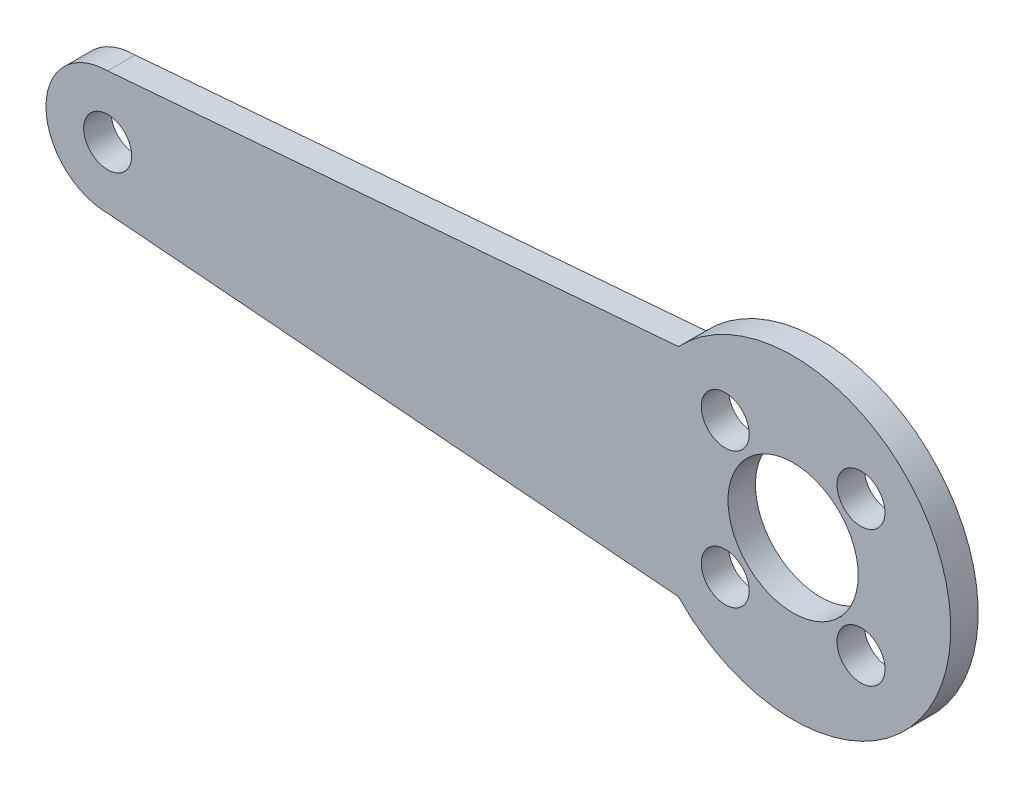
ISO-10303-21;
HEADER;
FILE_DESCRIPTION(('STEP AP214'),'2;1');
FILE_NAME('part.step','',(''),(''),'','','');
FILE_SCHEMA(('AUTOMOTIVE_DESIGN { 1 0 10303 214 1 1 1 1 }'));
ENDSEC;
DATA;
#1=APPLICATION_CONTEXT('core data for automotive mechanical design processes');
#2=APPLICATION_PROTOCOL_DEFINITION('international standard','automotive_design',2000,#1);
#3=PRODUCT_CONTEXT('',#1,'mechanical');
#4=PRODUCT('Part','Part','',(#3));
#5=PRODUCT_RELATED_PRODUCT_CATEGORY('part','',(#4));
#6=PRODUCT_DEFINITION_FORMATION('','',#4);
#7=PRODUCT_DEFINITION_CONTEXT('part definition',#1,'design');
#8=PRODUCT_DEFINITION('design','',#6,#7);
#9=PRODUCT_DEFINITION_SHAPE('','',#8);
#10=(LENGTH_UNIT() NAMED_UNIT(*) SI_UNIT(.MILLI.,.METRE.));
#11=(NAMED_UNIT(*) PLANE_ANGLE_UNIT() SI_UNIT($,.RADIAN.));
#12=(NAMED_UNIT(*) SI_UNIT($,.STERADIAN.) SOLID_ANGLE_UNIT());
#13=UNCERTAINTY_MEASURE_WITH_UNIT(LENGTH_MEASURE(1.E-05),#10,'distance_accuracy_value','');
#14=(GEOMETRIC_REPRESENTATION_CONTEXT(3) GLOBAL_UNCERTAINTY_ASSIGNED_CONTEXT((#13)) GLOBAL_UNIT_ASSIGNED_CONTEXT((#10,
#11,#12)) REPRESENTATION_CONTEXT('',''));
#15=CARTESIAN_POINT('',(0.,0.,0.));
#16=DIRECTION('',(0.,0.,1.));
#17=DIRECTION('',(1.,0.,0.));
#18=AXIS2_PLACEMENT_3D('',#15,#16,#17);
#19=CARTESIAN_POINT('',(-50.,0.,2.));
#20=DIRECTION('',(0.,0.,1.));
#21=DIRECTION('',(1.,0.,0.));
#22=AXIS2_PLACEMENT_3D('',#19,#20,#21);
#23=PLANE('',#22);
#24=CARTESIAN_POINT('',(0.,0.,2.));
#25=DIRECTION('',(0.,0.,1.));
#26=DIRECTION('',(1.,0.,0.));
#27=AXIS2_PLACEMENT_3D('',#24,#25,#26);
#28=CIRCLE('',#27,4.75);
#29=CARTESIAN_POINT('',(4.75,0.,2.));
#30=VERTEX_POINT('',#29);
#31=EDGE_CURVE('E229',#30,#30,#28,.T.);
#32=ORIENTED_EDGE('',*,*,#31,.F.);
#33=EDGE_LOOP('',(#32));
#34=FACE_BOUND('',#33,.T.);
#35=CARTESIAN_POINT('',(4.94974746830582,-4.94974746830585,2.));
#36=DIRECTION('',(0.,0.,1.));
#37=DIRECTION('',(1.,0.,0.));
#38=AXIS2_PLACEMENT_3D('',#35,#36,#37);
#39=CIRCLE('',#38,1.75);
#40=CARTESIAN_POINT('',(6.69974746830582,-4.94974746830585,2.));
#41=VERTEX_POINT('',#40);
#42=EDGE_CURVE('E214',#41,#41,#39,.T.);
#43=ORIENTED_EDGE('',*,*,#42,.F.);
#44=EDGE_LOOP('',(#43));
#45=FACE_BOUND('',#44,.T.);
#46=CARTESIAN_POINT('',(4.94974746830583,4.94974746830583,2.));
#47=DIRECTION('',(0.,0.,1.));
#48=DIRECTION('',(1.,0.,0.));
#49=AXIS2_PLACEMENT_3D('',#46,#47,#48);
#50=CIRCLE('',#49,1.75);
#51=CARTESIAN_POINT('',(6.69974746830583,4.94974746830583,2.));
#52=VERTEX_POINT('',#51);
#53=EDGE_CURVE('E202',#52,#52,#50,.T.);
#54=ORIENTED_EDGE('',*,*,#53,.F.);
#55=EDGE_LOOP('',(#54));
#56=FACE_BOUND('',#55,.T.);
#57=CARTESIAN_POINT('',(-50.,0.,2.));
#58=DIRECTION('',(0.,0.,1.));
#59=DIRECTION('',(1.,0.,0.));
#60=AXIS2_PLACEMENT_3D('',#57,#58,#59);
#61=CIRCLE('',#60,4.5);
#62=CARTESIAN_POINT('',(-50.,4.49999999999999,2.));
#63=VERTEX_POINT('',#62);
#64=CARTESIAN_POINT('',(-50.,-4.50000000000001,2.));
#65=VERTEX_POINT('',#64);
#66=EDGE_CURVE('E173',#63,#65,#61,.T.);
#67=ORIENTED_EDGE('',*,*,#66,.T.);
#68=DIRECTION('',(0.99667848722668,-0.0814370499191635,0.));
#69=VECTOR('',#68,1.);
#70=CARTESIAN_POINT('',(-50.,-4.50000000000001,2.));
#71=LINE('',#70,#69);
#72=CARTESIAN_POINT('',(-8.35438679497923,-7.90279831957496,2.));
#73=VERTEX_POINT('',#72);
#74=EDGE_CURVE('E166',#65,#73,#71,.T.);
#75=ORIENTED_EDGE('',*,*,#74,.T.);
#76=CARTESIAN_POINT('',(0.,0.,2.));
#77=DIRECTION('',(0.,0.,1.));
#78=DIRECTION('',(1.,0.,0.));
#79=AXIS2_PLACEMENT_3D('',#76,#77,#78);
#80=CIRCLE('',#79,11.5);
#81=CARTESIAN_POINT('',(-8.35438679497923,7.90279831957495,2.));
#82=VERTEX_POINT('',#81);
#83=EDGE_CURVE('E172',#73,#82,#80,.T.);
#84=ORIENTED_EDGE('',*,*,#83,.T.);
#85=DIRECTION('',(0.99667848722668,0.0814370499191637,0.));
#86=VECTOR('',#85,1.);
#87=CARTESIAN_POINT('',(-50.,4.49999999999999,2.));
#88=LINE('',#87,#86);
#89=EDGE_CURVE('E182',#63,#82,#88,.T.);
#90=ORIENTED_EDGE('',*,*,#89,.F.);
#91=EDGE_LOOP('',(#67,#75,#84,#90));
#92=FACE_BOUND('',#91,.T.);
#93=CARTESIAN_POINT('',(-50.,0.,2.));
#94=DIRECTION('',(0.,0.,1.));
#95=DIRECTION('',(1.,0.,0.));
#96=AXIS2_PLACEMENT_3D('',#93,#94,#95);
#97=CIRCLE('',#96,1.75);
#98=CARTESIAN_POINT('',(-48.25,0.,2.));
#99=VERTEX_POINT('',#98);
#100=EDGE_CURVE('E189',#99,#99,#97,.T.);
#101=ORIENTED_EDGE('',*,*,#100,.F.);
#102=EDGE_LOOP('',(#101));
#103=FACE_BOUND('',#102,.T.);
#104=CARTESIAN_POINT('',(-4.94974746830578,4.94974746830588,2.));
#105=DIRECTION('',(0.,0.,1.));
#106=DIRECTION('',(1.,0.,0.));
#107=AXIS2_PLACEMENT_3D('',#104,#105,#106);
#108=CIRCLE('',#107,1.75);
#109=CARTESIAN_POINT('',(-3.19974746830578,4.94974746830588,2.));
#110=VERTEX_POINT('',#109);
#111=EDGE_CURVE('E208',#110,#110,#108,.T.);
#112=ORIENTED_EDGE('',*,*,#111,.F.);
#113=EDGE_LOOP('',(#112));
#114=FACE_BOUND('',#113,.T.);
#115=CARTESIAN_POINT('',(-4.94974746830528,-4.94974746830639,2.));
#116=DIRECTION('',(0.,0.,1.));
#117=DIRECTION('',(1.,0.,0.));
#118=AXIS2_PLACEMENT_3D('',#115,#116,#117);
#119=CIRCLE('',#118,1.75000000000039);
#120=CARTESIAN_POINT('',(-3.19974746830488,-4.94974746830639,2.));
#121=VERTEX_POINT('',#120);
#122=EDGE_CURVE('E220',#121,#121,#119,.T.);
#123=ORIENTED_EDGE('',*,*,#122,.F.);
#124=EDGE_LOOP('',(#123));
#125=FACE_BOUND('',#124,.T.);
#126=ADVANCED_FACE('F123',(#34,#45,#56,#92,#103,#114,#125),#23,.T.);
#127=CARTESIAN_POINT('',(-50.,0.,0.));
#128=DIRECTION('',(0.,0.,1.));
#129=DIRECTION('',(1.,0.,0.));
#130=AXIS2_PLACEMENT_3D('',#127,#128,#129);
#131=PLANE('',#130);
#132=CARTESIAN_POINT('',(0.,0.,0.));
#133=DIRECTION('',(0.,0.,1.));
#134=DIRECTION('',(1.,0.,0.));
#135=AXIS2_PLACEMENT_3D('',#132,#133,#134);
#136=CIRCLE('',#135,4.75);
#137=CARTESIAN_POINT('',(4.75,0.,0.));
#138=VERTEX_POINT('',#137);
#139=EDGE_CURVE('E226',#138,#138,#136,.T.);
#140=ORIENTED_EDGE('',*,*,#139,.T.);
#141=EDGE_LOOP('',(#140));
#142=FACE_BOUND('',#141,.T.);
#143=CARTESIAN_POINT('',(-50.,0.,0.));
#144=DIRECTION('',(0.,0.,1.));
#145=DIRECTION('',(1.,0.,0.));
#146=AXIS2_PLACEMENT_3D('',#143,#144,#145);
#147=CIRCLE('',#146,4.5);
#148=CARTESIAN_POINT('',(-50.,4.49999999999999,0.));
#149=VERTEX_POINT('',#148);
#150=CARTESIAN_POINT('',(-50.,-4.50000000000001,0.));
#151=VERTEX_POINT('',#150);
#152=EDGE_CURVE('E187',#149,#151,#147,.T.);
#153=ORIENTED_EDGE('',*,*,#152,.F.);
#154=DIRECTION('',(0.99667848722668,0.0814370499191637,0.));
#155=VECTOR('',#154,1.);
#156=CARTESIAN_POINT('',(-50.,4.49999999999999,0.));
#157=LINE('',#156,#155);
#158=CARTESIAN_POINT('',(-8.35438679497923,7.90279831957495,0.));
#159=VERTEX_POINT('',#158);
#160=EDGE_CURVE('E193',#149,#159,#157,.T.);
#161=ORIENTED_EDGE('',*,*,#160,.T.);
#162=CARTESIAN_POINT('',(0.,0.,0.));
#163=DIRECTION('',(0.,0.,1.));
#164=DIRECTION('',(1.,0.,0.));
#165=AXIS2_PLACEMENT_3D('',#162,#163,#164);
#166=CIRCLE('',#165,11.5);
#167=CARTESIAN_POINT('',(-8.35438679497923,-7.90279831957496,0.));
#168=VERTEX_POINT('',#167);
#169=EDGE_CURVE('E191',#168,#159,#166,.T.);
#170=ORIENTED_EDGE('',*,*,#169,.F.);
#171=DIRECTION('',(0.99667848722668,-0.0814370499191635,0.));
#172=VECTOR('',#171,1.);
#173=CARTESIAN_POINT('',(-50.,-4.50000000000001,0.));
#174=LINE('',#173,#172);
#175=EDGE_CURVE('E178',#151,#168,#174,.T.);
#176=ORIENTED_EDGE('',*,*,#175,.F.);
#177=EDGE_LOOP('',(#153,#161,#170,#176));
#178=FACE_BOUND('',#177,.T.);
#179=CARTESIAN_POINT('',(-50.,0.,0.));
#180=DIRECTION('',(0.,0.,1.));
#181=DIRECTION('',(1.,0.,0.));
#182=AXIS2_PLACEMENT_3D('',#179,#180,#181);
#183=CIRCLE('',#182,1.75);
#184=CARTESIAN_POINT('',(-48.25,0.,0.));
#185=VERTEX_POINT('',#184);
#186=EDGE_CURVE('E199',#185,#185,#183,.T.);
#187=ORIENTED_EDGE('',*,*,#186,.T.);
#188=EDGE_LOOP('',(#187));
#189=FACE_BOUND('',#188,.T.);
#190=CARTESIAN_POINT('',(4.94974746830583,4.94974746830583,0.));
#191=DIRECTION('',(0.,0.,1.));
#192=DIRECTION('',(1.,0.,0.));
#193=AXIS2_PLACEMENT_3D('',#190,#191,#192);
#194=CIRCLE('',#193,1.75);
#195=CARTESIAN_POINT('',(6.69974746830583,4.94974746830583,0.));
#196=VERTEX_POINT('',#195);
#197=EDGE_CURVE('E205',#196,#196,#194,.T.);
#198=ORIENTED_EDGE('',*,*,#197,.T.);
#199=EDGE_LOOP('',(#198));
#200=FACE_BOUND('',#199,.T.);
#201=CARTESIAN_POINT('',(-4.94974746830578,4.94974746830588,0.));
#202=DIRECTION('',(0.,0.,1.));
#203=DIRECTION('',(1.,0.,0.));
#204=AXIS2_PLACEMENT_3D('',#201,#202,#203);
#205=CIRCLE('',#204,1.75);
#206=CARTESIAN_POINT('',(-3.19974746830578,4.94974746830588,0.));
#207=VERTEX_POINT('',#206);
#208=EDGE_CURVE('E211',#207,#207,#205,.T.);
#209=ORIENTED_EDGE('',*,*,#208,.T.);
#210=EDGE_LOOP('',(#209));
#211=FACE_BOUND('',#210,.T.);
#212=CARTESIAN_POINT('',(4.94974746830582,-4.94974746830585,0.));
#213=DIRECTION('',(0.,0.,1.));
#214=DIRECTION('',(1.,0.,0.));
#215=AXIS2_PLACEMENT_3D('',#212,#213,#214);
#216=CIRCLE('',#215,1.75);
#217=CARTESIAN_POINT('',(6.69974746830582,-4.94974746830585,0.));
#218=VERTEX_POINT('',#217);
#219=EDGE_CURVE('E217',#218,#218,#216,.T.);
#220=ORIENTED_EDGE('',*,*,#219,.T.);
#221=EDGE_LOOP('',(#220));
#222=FACE_BOUND('',#221,.T.);
#223=CARTESIAN_POINT('',(-4.94974746830528,-4.94974746830639,0.));
#224=DIRECTION('',(0.,0.,1.));
#225=DIRECTION('',(1.,0.,0.));
#226=AXIS2_PLACEMENT_3D('',#223,#224,#225);
#227=CIRCLE('',#226,1.75000000000039);
#228=CARTESIAN_POINT('',(-3.19974746830488,-4.94974746830639,0.));
#229=VERTEX_POINT('',#228);
#230=EDGE_CURVE('E223',#229,#229,#227,.T.);
#231=ORIENTED_EDGE('',*,*,#230,.T.);
#232=EDGE_LOOP('',(#231));
#233=FACE_BOUND('',#232,.T.);
#234=ADVANCED_FACE('F235',(#142,#178,#189,#200,#211,#222,#233),#131,.F.);
#235=CARTESIAN_POINT('',(-50.,0.,2.));
#236=DIRECTION('',(0.,0.,-1.));
#237=DIRECTION('',(-1.,0.,0.));
#238=AXIS2_PLACEMENT_3D('',#235,#236,#237);
#239=CYLINDRICAL_SURFACE('',#238,4.5);
#240=ORIENTED_EDGE('',*,*,#152,.T.);
#241=DIRECTION('',(0.,0.,-1.));
#242=VECTOR('',#241,1.);
#243=CARTESIAN_POINT('',(-50.,-4.50000000000001,2.));
#244=LINE('',#243,#242);
#245=EDGE_CURVE('E14',#65,#151,#244,.T.);
#246=ORIENTED_EDGE('',*,*,#245,.F.);
#247=ORIENTED_EDGE('',*,*,#66,.F.);
#248=DIRECTION('',(0.,0.,-1.));
#249=VECTOR('',#248,1.);
#250=CARTESIAN_POINT('',(-50.,4.49999999999999,2.));
#251=LINE('',#250,#249);
#252=EDGE_CURVE('E140',#63,#149,#251,.T.);
#253=ORIENTED_EDGE('',*,*,#252,.T.);
#254=EDGE_LOOP('',(#240,#246,#247,#253));
#255=FACE_BOUND('',#254,.T.);
#256=ADVANCED_FACE('F125',(#255),#239,.T.);
#257=CARTESIAN_POINT('',(-50.,-4.50000000000001,2.));
#258=DIRECTION('',(0.0814370499191635,0.99667848722668,0.));
#259=DIRECTION('',(-0.99667848722668,0.0814370499191635,0.));
#260=AXIS2_PLACEMENT_3D('',#257,#258,#259);
#261=PLANE('',#260);
#262=ORIENTED_EDGE('',*,*,#175,.T.);
#263=DIRECTION('',(0.,0.,-1.));
#264=VECTOR('',#263,1.);
#265=CARTESIAN_POINT('',(-8.35438679497923,-7.90279831957496,2.));
#266=LINE('',#265,#264);
#267=EDGE_CURVE('E132',#73,#168,#266,.T.);
#268=ORIENTED_EDGE('',*,*,#267,.F.);
#269=ORIENTED_EDGE('',*,*,#74,.F.);
#270=ORIENTED_EDGE('',*,*,#245,.T.);
#271=EDGE_LOOP('',(#262,#268,#269,#270));
#272=FACE_BOUND('',#271,.T.);
#273=ADVANCED_FACE('F177',(#272),#261,.F.);
#274=CARTESIAN_POINT('',(0.,0.,2.));
#275=DIRECTION('',(0.,0.,-1.));
#276=DIRECTION('',(-1.,0.,0.));
#277=AXIS2_PLACEMENT_3D('',#274,#275,#276);
#278=CYLINDRICAL_SURFACE('',#277,11.5);
#279=ORIENTED_EDGE('',*,*,#169,.T.);
#280=DIRECTION('',(0.,0.,-1.));
#281=VECTOR('',#280,1.);
#282=CARTESIAN_POINT('',(-8.35438679497923,7.90279831957495,2.));
#283=LINE('',#282,#281);
#284=EDGE_CURVE('E155',#82,#159,#283,.T.);
#285=ORIENTED_EDGE('',*,*,#284,.F.);
#286=ORIENTED_EDGE('',*,*,#83,.F.);
#287=ORIENTED_EDGE('',*,*,#267,.T.);
#288=EDGE_LOOP('',(#279,#285,#286,#287));
#289=FACE_BOUND('',#288,.T.);
#290=ADVANCED_FACE('F181',(#289),#278,.T.);
#291=CARTESIAN_POINT('',(-50.,4.49999999999999,2.));
#292=DIRECTION('',(-0.0814370499191638,0.99667848722668,0.));
#293=DIRECTION('',(-0.99667848722668,-0.0814370499191638,0.));
#294=AXIS2_PLACEMENT_3D('',#291,#292,#293);
#295=PLANE('',#294);
#296=ORIENTED_EDGE('',*,*,#160,.F.);
#297=ORIENTED_EDGE('',*,*,#252,.F.);
#298=ORIENTED_EDGE('',*,*,#89,.T.);
#299=ORIENTED_EDGE('',*,*,#284,.T.);
#300=EDGE_LOOP('',(#296,#297,#298,#299));
#301=FACE_BOUND('',#300,.T.);
#302=ADVANCED_FACE('F282',(#301),#295,.T.);
#303=CARTESIAN_POINT('',(-50.,0.,2.));
#304=DIRECTION('',(0.,0.,-1.));
#305=DIRECTION('',(-1.,0.,0.));
#306=AXIS2_PLACEMENT_3D('',#303,#304,#305);
#307=CYLINDRICAL_SURFACE('',#306,1.75);
#308=ORIENTED_EDGE('',*,*,#100,.T.);
#309=EDGE_LOOP('',(#308));
#310=FACE_BOUND('',#309,.T.);
#311=ORIENTED_EDGE('',*,*,#186,.F.);
#312=EDGE_LOOP('',(#311));
#313=FACE_BOUND('',#312,.T.);
#314=ADVANCED_FACE('F255',(#310,#313),#307,.F.);
#315=CARTESIAN_POINT('',(4.94974746830583,4.94974746830583,2.));
#316=DIRECTION('',(0.,0.,-1.));
#317=DIRECTION('',(-1.,0.,0.));
#318=AXIS2_PLACEMENT_3D('',#315,#316,#317);
#319=CYLINDRICAL_SURFACE('',#318,1.75);
#320=ORIENTED_EDGE('',*,*,#53,.T.);
#321=EDGE_LOOP('',(#320));
#322=FACE_BOUND('',#321,.T.);
#323=ORIENTED_EDGE('',*,*,#197,.F.);
#324=EDGE_LOOP('',(#323));
#325=FACE_BOUND('',#324,.T.);
#326=ADVANCED_FACE('F251',(#322,#325),#319,.F.);
#327=CARTESIAN_POINT('',(-4.94974746830578,4.94974746830588,2.));
#328=DIRECTION('',(0.,0.,-1.));
#329=DIRECTION('',(-1.,0.,0.));
#330=AXIS2_PLACEMENT_3D('',#327,#328,#329);
#331=CYLINDRICAL_SURFACE('',#330,1.75);
#332=ORIENTED_EDGE('',*,*,#111,.T.);
#333=EDGE_LOOP('',(#332));
#334=FACE_BOUND('',#333,.T.);
#335=ORIENTED_EDGE('',*,*,#208,.F.);
#336=EDGE_LOOP('',(#335));
#337=FACE_BOUND('',#336,.T.);
#338=ADVANCED_FACE('F254',(#334,#337),#331,.F.);
#339=CARTESIAN_POINT('',(4.94974746830582,-4.94974746830585,2.));
#340=DIRECTION('',(0.,0.,-1.));
#341=DIRECTION('',(-1.,0.,0.));
#342=AXIS2_PLACEMENT_3D('',#339,#340,#341);
#343=CYLINDRICAL_SURFACE('',#342,1.75);
#344=ORIENTED_EDGE('',*,*,#42,.T.);
#345=EDGE_LOOP('',(#344));
#346=FACE_BOUND('',#345,.T.);
#347=ORIENTED_EDGE('',*,*,#219,.F.);
#348=EDGE_LOOP('',(#347));
#349=FACE_BOUND('',#348,.T.);
#350=ADVANCED_FACE('F269',(#346,#349),#343,.F.);
#351=CARTESIAN_POINT('',(-4.94974746830528,-4.94974746830639,2.));
#352=DIRECTION('',(0.,0.,-1.));
#353=DIRECTION('',(-1.,0.,0.));
#354=AXIS2_PLACEMENT_3D('',#351,#352,#353);
#355=CYLINDRICAL_SURFACE('',#354,1.75000000000039);
#356=ORIENTED_EDGE('',*,*,#122,.T.);
#357=EDGE_LOOP('',(#356));
#358=FACE_BOUND('',#357,.T.);
#359=ORIENTED_EDGE('',*,*,#230,.F.);
#360=EDGE_LOOP('',(#359));
#361=FACE_BOUND('',#360,.T.);
#362=ADVANCED_FACE('F240',(#358,#361),#355,.F.);
#363=CARTESIAN_POINT('',(0.,0.,0.));
#364=DIRECTION('',(0.,0.,1.));
#365=DIRECTION('',(1.,0.,0.));
#366=AXIS2_PLACEMENT_3D('',#363,#364,#365);
#367=CYLINDRICAL_SURFACE('',#366,4.75);
#368=ORIENTED_EDGE('',*,*,#139,.F.);
#369=EDGE_LOOP('',(#368));
#370=FACE_BOUND('',#369,.T.);
#371=ORIENTED_EDGE('',*,*,#31,.T.);
#372=EDGE_LOOP('',(#371));
#373=FACE_BOUND('',#372,.T.);
#374=ADVANCED_FACE('F237',(#370,#373),#367,.F.);
#375=CLOSED_SHELL('',(#126,#234,#256,#273,#290,#302,#314,#326,#338,#350,#362,#374));
#376=MANIFOLD_SOLID_BREP('B2',#375);
#377=ADVANCED_BREP_SHAPE_REPRESENTATION('',(#18,#376),#14);
#378=SHAPE_DEFINITION_REPRESENTATION(#9,#377);
ENDSEC;
END-ISO-10303-21;
